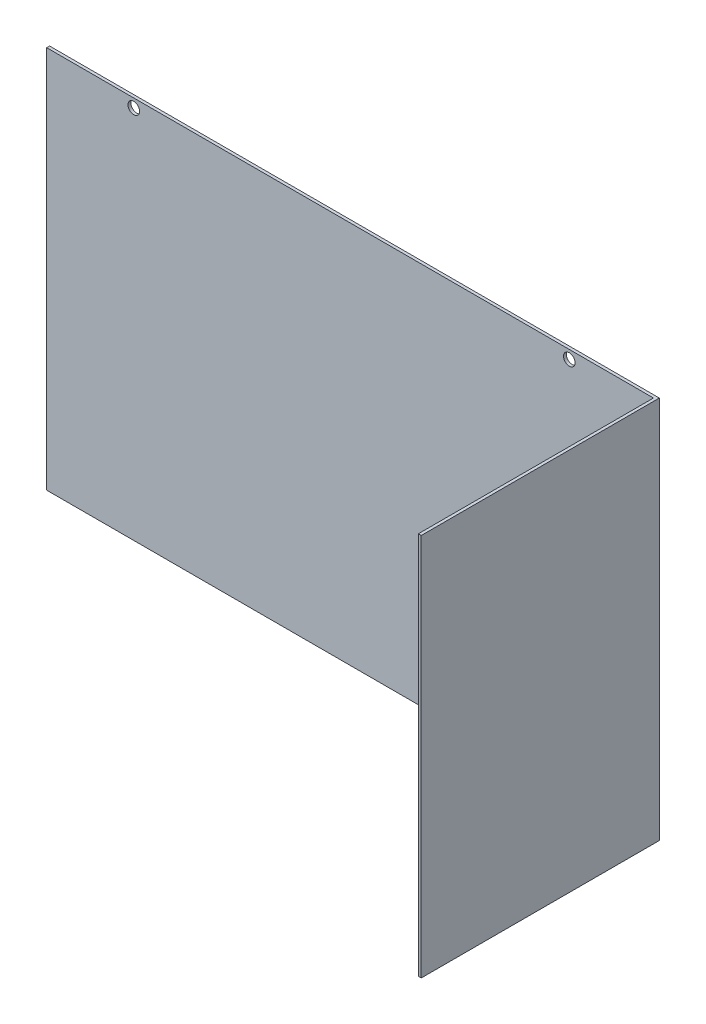
ISO-10303-21;
HEADER;
FILE_DESCRIPTION(('STEP AP214'),'2;1');
FILE_NAME('part.step','',(''),(''),'','','');
FILE_SCHEMA(('AUTOMOTIVE_DESIGN { 1 0 10303 214 1 1 1 1 }'));
ENDSEC;
DATA;
#1=APPLICATION_CONTEXT('core data for automotive mechanical design processes');
#2=APPLICATION_PROTOCOL_DEFINITION('international standard','automotive_design',2000,#1);
#3=PRODUCT_CONTEXT('',#1,'mechanical');
#4=PRODUCT('Part','Part','',(#3));
#5=PRODUCT_RELATED_PRODUCT_CATEGORY('part','',(#4));
#6=PRODUCT_DEFINITION_FORMATION('','',#4);
#7=PRODUCT_DEFINITION_CONTEXT('part definition',#1,'design');
#8=PRODUCT_DEFINITION('design','',#6,#7);
#9=PRODUCT_DEFINITION_SHAPE('','',#8);
#10=(LENGTH_UNIT() NAMED_UNIT(*) SI_UNIT(.MILLI.,.METRE.));
#11=(NAMED_UNIT(*) PLANE_ANGLE_UNIT() SI_UNIT($,.RADIAN.));
#12=(NAMED_UNIT(*) SI_UNIT($,.STERADIAN.) SOLID_ANGLE_UNIT());
#13=UNCERTAINTY_MEASURE_WITH_UNIT(LENGTH_MEASURE(1.E-05),#10,'distance_accuracy_value','');
#14=(GEOMETRIC_REPRESENTATION_CONTEXT(3) GLOBAL_UNCERTAINTY_ASSIGNED_CONTEXT((#13)) GLOBAL_UNIT_ASSIGNED_CONTEXT((#10,
#11,#12)) REPRESENTATION_CONTEXT('',''));
#15=CARTESIAN_POINT('',(0.,0.,0.));
#16=DIRECTION('',(0.,0.,1.));
#17=DIRECTION('',(1.,0.,0.));
#18=AXIS2_PLACEMENT_3D('',#15,#16,#17);
#19=CARTESIAN_POINT('',(0.,0.,1.));
#20=DIRECTION('',(0.,0.,-1.));
#21=DIRECTION('',(-1.,0.,0.));
#22=AXIS2_PLACEMENT_3D('',#19,#20,#21);
#23=PLANE('',#22);
#24=CARTESIAN_POINT('',(75.,63.,1.));
#25=DIRECTION('',(0.,0.,1.));
#26=DIRECTION('',(1.,0.,0.));
#27=AXIS2_PLACEMENT_3D('',#24,#25,#26);
#28=CIRCLE('',#27,2.);
#29=CARTESIAN_POINT('',(77.,63.,1.));
#30=VERTEX_POINT('',#29);
#31=EDGE_CURVE('E147',#30,#30,#28,.T.);
#32=ORIENTED_EDGE('',*,*,#31,.F.);
#33=EDGE_LOOP('',(#32));
#34=FACE_BOUND('',#33,.T.);
#35=CARTESIAN_POINT('',(-75.,63.,1.));
#36=DIRECTION('',(0.,0.,1.));
#37=DIRECTION('',(1.,0.,0.));
#38=AXIS2_PLACEMENT_3D('',#35,#36,#37);
#39=CIRCLE('',#38,2.);
#40=CARTESIAN_POINT('',(-73.,63.,1.));
#41=VERTEX_POINT('',#40);
#42=EDGE_CURVE('E141',#41,#41,#39,.T.);
#43=ORIENTED_EDGE('',*,*,#42,.F.);
#44=EDGE_LOOP('',(#43));
#45=FACE_BOUND('',#44,.T.);
#46=DIRECTION('',(0.,-1.,0.));
#47=VECTOR('',#46,1.);
#48=CARTESIAN_POINT('',(104.,66.,1.));
#49=LINE('',#48,#47);
#50=CARTESIAN_POINT('',(104.,66.,1.));
#51=VERTEX_POINT('',#50);
#52=CARTESIAN_POINT('',(104.,-66.,1.));
#53=VERTEX_POINT('',#52);
#54=EDGE_CURVE('E51',#51,#53,#49,.T.);
#55=ORIENTED_EDGE('',*,*,#54,.F.);
#56=DIRECTION('',(-1.,0.,0.));
#57=VECTOR('',#56,1.);
#58=CARTESIAN_POINT('',(-105.,66.,1.));
#59=LINE('',#58,#57);
#60=CARTESIAN_POINT('',(-105.,66.,1.));
#61=VERTEX_POINT('',#60);
#62=EDGE_CURVE('E56',#51,#61,#59,.T.);
#63=ORIENTED_EDGE('',*,*,#62,.T.);
#64=DIRECTION('',(0.,-1.,0.));
#65=VECTOR('',#64,1.);
#66=CARTESIAN_POINT('',(-105.,-66.,1.));
#67=LINE('',#66,#65);
#68=CARTESIAN_POINT('',(-105.,-66.,1.));
#69=VERTEX_POINT('',#68);
#70=EDGE_CURVE('E87',#61,#69,#67,.T.);
#71=ORIENTED_EDGE('',*,*,#70,.T.);
#72=DIRECTION('',(1.,0.,0.));
#73=VECTOR('',#72,1.);
#74=CARTESIAN_POINT('',(-105.,-66.,1.));
#75=LINE('',#74,#73);
#76=EDGE_CURVE('E111',#69,#53,#75,.T.);
#77=ORIENTED_EDGE('',*,*,#76,.T.);
#78=EDGE_LOOP('',(#55,#63,#71,#77));
#79=FACE_BOUND('',#78,.T.);
#80=ADVANCED_FACE('F34',(#34,#45,#79),#23,.F.);
#81=CARTESIAN_POINT('',(-105.,-66.,1.));
#82=DIRECTION('',(1.,0.,0.));
#83=DIRECTION('',(0.,0.,-1.));
#84=AXIS2_PLACEMENT_3D('',#81,#82,#83);
#85=PLANE('',#84);
#86=DIRECTION('',(0.,-1.,0.));
#87=VECTOR('',#86,1.);
#88=CARTESIAN_POINT('',(-105.,-66.,0.));
#89=LINE('',#88,#87);
#90=CARTESIAN_POINT('',(-105.,66.,0.));
#91=VERTEX_POINT('',#90);
#92=CARTESIAN_POINT('',(-105.,-66.,0.));
#93=VERTEX_POINT('',#92);
#94=EDGE_CURVE('E93',#91,#93,#89,.T.);
#95=ORIENTED_EDGE('',*,*,#94,.T.);
#96=DIRECTION('',(0.,0.,-1.));
#97=VECTOR('',#96,1.);
#98=CARTESIAN_POINT('',(-105.,-66.,1.));
#99=LINE('',#98,#97);
#100=EDGE_CURVE('E11',#69,#93,#99,.T.);
#101=ORIENTED_EDGE('',*,*,#100,.F.);
#102=ORIENTED_EDGE('',*,*,#70,.F.);
#103=DIRECTION('',(0.,0.,-1.));
#104=VECTOR('',#103,1.);
#105=CARTESIAN_POINT('',(-105.,66.,1.));
#106=LINE('',#105,#104);
#107=EDGE_CURVE('E79',#61,#91,#106,.T.);
#108=ORIENTED_EDGE('',*,*,#107,.T.);
#109=EDGE_LOOP('',(#95,#101,#102,#108));
#110=FACE_BOUND('',#109,.T.);
#111=ADVANCED_FACE('F36',(#110),#85,.F.);
#112=CARTESIAN_POINT('',(-105.,-66.,1.));
#113=DIRECTION('',(0.,1.,0.));
#114=DIRECTION('',(0.,0.,1.));
#115=AXIS2_PLACEMENT_3D('',#112,#113,#114);
#116=PLANE('',#115);
#117=DIRECTION('',(1.,0.,0.));
#118=VECTOR('',#117,1.);
#119=CARTESIAN_POINT('',(-105.,-66.,0.));
#120=LINE('',#119,#118);
#121=CARTESIAN_POINT('',(105.,-66.,0.));
#122=VERTEX_POINT('',#121);
#123=EDGE_CURVE('E96',#93,#122,#120,.T.);
#124=ORIENTED_EDGE('',*,*,#123,.T.);
#125=DIRECTION('',(0.,0.,-1.));
#126=VECTOR('',#125,1.);
#127=CARTESIAN_POINT('',(105.,-66.,1.));
#128=LINE('',#127,#126);
#129=CARTESIAN_POINT('',(105.,-66.,82.));
#130=VERTEX_POINT('',#129);
#131=EDGE_CURVE('E43',#130,#122,#128,.T.);
#132=ORIENTED_EDGE('',*,*,#131,.F.);
#133=DIRECTION('',(1.,0.,0.));
#134=VECTOR('',#133,1.);
#135=CARTESIAN_POINT('',(104.,-66.,82.));
#136=LINE('',#135,#134);
#137=CARTESIAN_POINT('',(104.,-66.,82.));
#138=VERTEX_POINT('',#137);
#139=EDGE_CURVE('E134',#138,#130,#136,.T.);
#140=ORIENTED_EDGE('',*,*,#139,.F.);
#141=DIRECTION('',(0.,0.,-1.));
#142=VECTOR('',#141,1.);
#143=CARTESIAN_POINT('',(104.,-66.,82.));
#144=LINE('',#143,#142);
#145=EDGE_CURVE('E97',#138,#53,#144,.T.);
#146=ORIENTED_EDGE('',*,*,#145,.T.);
#147=ORIENTED_EDGE('',*,*,#76,.F.);
#148=ORIENTED_EDGE('',*,*,#100,.T.);
#149=EDGE_LOOP('',(#124,#132,#140,#146,#147,#148));
#150=FACE_BOUND('',#149,.T.);
#151=ADVANCED_FACE('F186',(#150),#116,.F.);
#152=CARTESIAN_POINT('',(105.,-66.,1.));
#153=DIRECTION('',(-1.,0.,0.));
#154=DIRECTION('',(0.,-1.,0.));
#155=AXIS2_PLACEMENT_3D('',#152,#153,#154);
#156=PLANE('',#155);
#157=DIRECTION('',(0.,1.,0.));
#158=VECTOR('',#157,1.);
#159=CARTESIAN_POINT('',(105.,-66.,0.));
#160=LINE('',#159,#158);
#161=CARTESIAN_POINT('',(105.,66.,0.));
#162=VERTEX_POINT('',#161);
#163=EDGE_CURVE('E88',#122,#162,#160,.T.);
#164=ORIENTED_EDGE('',*,*,#163,.T.);
#165=DIRECTION('',(0.,0.,-1.));
#166=VECTOR('',#165,1.);
#167=CARTESIAN_POINT('',(105.,66.,1.));
#168=LINE('',#167,#166);
#169=CARTESIAN_POINT('',(105.,66.,82.));
#170=VERTEX_POINT('',#169);
#171=EDGE_CURVE('E83',#170,#162,#168,.T.);
#172=ORIENTED_EDGE('',*,*,#171,.F.);
#173=DIRECTION('',(0.,1.,0.));
#174=VECTOR('',#173,1.);
#175=CARTESIAN_POINT('',(105.,66.,82.));
#176=LINE('',#175,#174);
#177=EDGE_CURVE('E130',#130,#170,#176,.T.);
#178=ORIENTED_EDGE('',*,*,#177,.F.);
#179=ORIENTED_EDGE('',*,*,#131,.T.);
#180=EDGE_LOOP('',(#164,#172,#178,#179));
#181=FACE_BOUND('',#180,.T.);
#182=ADVANCED_FACE('F184',(#181),#156,.F.);
#183=CARTESIAN_POINT('',(-105.,66.,1.));
#184=DIRECTION('',(0.,-1.,0.));
#185=DIRECTION('',(1.,0.,0.));
#186=AXIS2_PLACEMENT_3D('',#183,#184,#185);
#187=PLANE('',#186);
#188=DIRECTION('',(-1.,0.,0.));
#189=VECTOR('',#188,1.);
#190=CARTESIAN_POINT('',(-105.,66.,0.));
#191=LINE('',#190,#189);
#192=EDGE_CURVE('E76',#162,#91,#191,.T.);
#193=ORIENTED_EDGE('',*,*,#192,.T.);
#194=ORIENTED_EDGE('',*,*,#107,.F.);
#195=ORIENTED_EDGE('',*,*,#62,.F.);
#196=DIRECTION('',(0.,0.,-1.));
#197=VECTOR('',#196,1.);
#198=CARTESIAN_POINT('',(104.,66.,82.));
#199=LINE('',#198,#197);
#200=CARTESIAN_POINT('',(104.,66.,82.));
#201=VERTEX_POINT('',#200);
#202=EDGE_CURVE('E101',#201,#51,#199,.T.);
#203=ORIENTED_EDGE('',*,*,#202,.F.);
#204=DIRECTION('',(-1.,0.,0.));
#205=VECTOR('',#204,1.);
#206=CARTESIAN_POINT('',(104.,66.,82.));
#207=LINE('',#206,#205);
#208=EDGE_CURVE('E118',#170,#201,#207,.T.);
#209=ORIENTED_EDGE('',*,*,#208,.F.);
#210=ORIENTED_EDGE('',*,*,#171,.T.);
#211=EDGE_LOOP('',(#193,#194,#195,#203,#209,#210));
#212=FACE_BOUND('',#211,.T.);
#213=ADVANCED_FACE('F78',(#212),#187,.F.);
#214=CARTESIAN_POINT('',(0.,0.,0.));
#215=DIRECTION('',(0.,0.,-1.));
#216=DIRECTION('',(-1.,0.,0.));
#217=AXIS2_PLACEMENT_3D('',#214,#215,#216);
#218=PLANE('',#217);
#219=CARTESIAN_POINT('',(75.,63.,0.));
#220=DIRECTION('',(0.,0.,1.));
#221=DIRECTION('',(1.,0.,0.));
#222=AXIS2_PLACEMENT_3D('',#219,#220,#221);
#223=CIRCLE('',#222,2.);
#224=CARTESIAN_POINT('',(77.,63.,0.));
#225=VERTEX_POINT('',#224);
#226=EDGE_CURVE('E144',#225,#225,#223,.T.);
#227=ORIENTED_EDGE('',*,*,#226,.T.);
#228=EDGE_LOOP('',(#227));
#229=FACE_BOUND('',#228,.T.);
#230=CARTESIAN_POINT('',(-75.,63.,0.));
#231=DIRECTION('',(0.,0.,1.));
#232=DIRECTION('',(1.,0.,0.));
#233=AXIS2_PLACEMENT_3D('',#230,#231,#232);
#234=CIRCLE('',#233,2.);
#235=CARTESIAN_POINT('',(-73.,63.,0.));
#236=VERTEX_POINT('',#235);
#237=EDGE_CURVE('E123',#236,#236,#234,.T.);
#238=ORIENTED_EDGE('',*,*,#237,.T.);
#239=EDGE_LOOP('',(#238));
#240=FACE_BOUND('',#239,.T.);
#241=ORIENTED_EDGE('',*,*,#94,.F.);
#242=ORIENTED_EDGE('',*,*,#192,.F.);
#243=ORIENTED_EDGE('',*,*,#163,.F.);
#244=ORIENTED_EDGE('',*,*,#123,.F.);
#245=EDGE_LOOP('',(#241,#242,#243,#244));
#246=FACE_BOUND('',#245,.T.);
#247=ADVANCED_FACE('F95',(#229,#240,#246),#218,.T.);
#248=CARTESIAN_POINT('',(104.,66.,82.));
#249=DIRECTION('',(1.,0.,0.));
#250=DIRECTION('',(0.,0.,-1.));
#251=AXIS2_PLACEMENT_3D('',#248,#249,#250);
#252=PLANE('',#251);
#253=ORIENTED_EDGE('',*,*,#54,.T.);
#254=ORIENTED_EDGE('',*,*,#145,.F.);
#255=DIRECTION('',(0.,-1.,0.));
#256=VECTOR('',#255,1.);
#257=CARTESIAN_POINT('',(104.,66.,82.));
#258=LINE('',#257,#256);
#259=EDGE_CURVE('E122',#201,#138,#258,.T.);
#260=ORIENTED_EDGE('',*,*,#259,.F.);
#261=ORIENTED_EDGE('',*,*,#202,.T.);
#262=EDGE_LOOP('',(#253,#254,#260,#261));
#263=FACE_BOUND('',#262,.T.);
#264=ADVANCED_FACE('F174',(#263),#252,.F.);
#265=CARTESIAN_POINT('',(0.,0.,82.));
#266=DIRECTION('',(0.,0.,1.));
#267=DIRECTION('',(1.,0.,0.));
#268=AXIS2_PLACEMENT_3D('',#265,#266,#267);
#269=PLANE('',#268);
#270=ORIENTED_EDGE('',*,*,#259,.T.);
#271=ORIENTED_EDGE('',*,*,#139,.T.);
#272=ORIENTED_EDGE('',*,*,#177,.T.);
#273=ORIENTED_EDGE('',*,*,#208,.T.);
#274=EDGE_LOOP('',(#270,#271,#272,#273));
#275=FACE_BOUND('',#274,.T.);
#276=ADVANCED_FACE('F168',(#275),#269,.T.);
#277=CARTESIAN_POINT('',(-75.,63.,0.));
#278=DIRECTION('',(0.,0.,1.));
#279=DIRECTION('',(1.,0.,0.));
#280=AXIS2_PLACEMENT_3D('',#277,#278,#279);
#281=CYLINDRICAL_SURFACE('',#280,2.);
#282=ORIENTED_EDGE('',*,*,#237,.F.);
#283=EDGE_LOOP('',(#282));
#284=FACE_BOUND('',#283,.T.);
#285=ORIENTED_EDGE('',*,*,#42,.T.);
#286=EDGE_LOOP('',(#285));
#287=FACE_BOUND('',#286,.T.);
#288=ADVANCED_FACE('F158',(#284,#287),#281,.F.);
#289=CARTESIAN_POINT('',(75.,63.,0.));
#290=DIRECTION('',(0.,0.,1.));
#291=DIRECTION('',(1.,0.,0.));
#292=AXIS2_PLACEMENT_3D('',#289,#290,#291);
#293=CYLINDRICAL_SURFACE('',#292,2.);
#294=ORIENTED_EDGE('',*,*,#226,.F.);
#295=EDGE_LOOP('',(#294));
#296=FACE_BOUND('',#295,.T.);
#297=ORIENTED_EDGE('',*,*,#31,.T.);
#298=EDGE_LOOP('',(#297));
#299=FACE_BOUND('',#298,.T.);
#300=ADVANCED_FACE('F155',(#296,#299),#293,.F.);
#301=CLOSED_SHELL('',(#80,#111,#151,#182,#213,#247,#264,#276,#288,#300));
#302=MANIFOLD_SOLID_BREP('B2',#301);
#303=ADVANCED_BREP_SHAPE_REPRESENTATION('',(#18,#302),#14);
#304=SHAPE_DEFINITION_REPRESENTATION(#9,#303);
ENDSEC;
END-ISO-10303-21;
